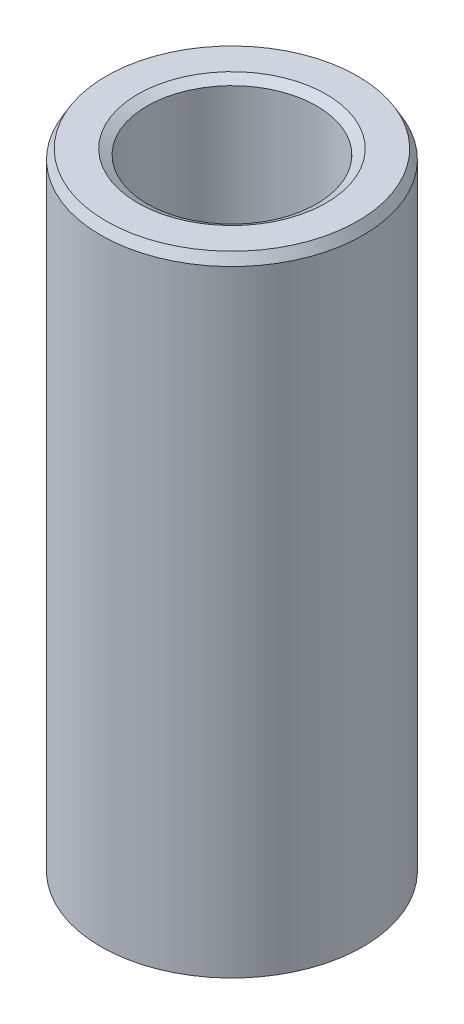
ISO-10303-21;
HEADER;
FILE_DESCRIPTION(('STEP AP214'),'2;1');
FILE_NAME('part.step','',(''),(''),'','','');
FILE_SCHEMA(('AUTOMOTIVE_DESIGN { 1 0 10303 214 1 1 1 1 }'));
ENDSEC;
DATA;
#1=APPLICATION_CONTEXT('core data for automotive mechanical design processes');
#2=APPLICATION_PROTOCOL_DEFINITION('international standard','automotive_design',2000,#1);
#3=PRODUCT_CONTEXT('',#1,'mechanical');
#4=PRODUCT('Part','Part','',(#3));
#5=PRODUCT_RELATED_PRODUCT_CATEGORY('part','',(#4));
#6=PRODUCT_DEFINITION_FORMATION('','',#4);
#7=PRODUCT_DEFINITION_CONTEXT('part definition',#1,'design');
#8=PRODUCT_DEFINITION('design','',#6,#7);
#9=PRODUCT_DEFINITION_SHAPE('','',#8);
#10=(LENGTH_UNIT() NAMED_UNIT(*) SI_UNIT(.MILLI.,.METRE.));
#11=(NAMED_UNIT(*) PLANE_ANGLE_UNIT() SI_UNIT($,.RADIAN.));
#12=(NAMED_UNIT(*) SI_UNIT($,.STERADIAN.) SOLID_ANGLE_UNIT());
#13=UNCERTAINTY_MEASURE_WITH_UNIT(LENGTH_MEASURE(1.E-05),#10,'distance_accuracy_value','');
#14=(GEOMETRIC_REPRESENTATION_CONTEXT(3) GLOBAL_UNCERTAINTY_ASSIGNED_CONTEXT((#13)) GLOBAL_UNIT_ASSIGNED_CONTEXT((#10,
#11,#12)) REPRESENTATION_CONTEXT('',''));
#15=CARTESIAN_POINT('',(0.,0.,0.));
#16=DIRECTION('',(0.,0.,1.));
#17=DIRECTION('',(1.,0.,0.));
#18=AXIS2_PLACEMENT_3D('',#15,#16,#17);
#19=CARTESIAN_POINT('',(0.,156.379065142094,0.));
#20=DIRECTION('',(0.,-1.,0.));
#21=DIRECTION('',(0.,0.,-1.));
#22=AXIS2_PLACEMENT_3D('',#19,#20,#21);
#23=CYLINDRICAL_SURFACE('',#22,32.5);
#24=CARTESIAN_POINT('',(0.,1.35039653749686,0.));
#25=DIRECTION('',(0.,1.,0.));
#26=DIRECTION('',(0.,0.,1.));
#27=AXIS2_PLACEMENT_3D('',#24,#25,#26);
#28=CIRCLE('',#27,32.5);
#29=CARTESIAN_POINT('',(0.,1.35039653749686,32.5));
#30=VERTEX_POINT('',#29);
#31=EDGE_CURVE('E10',#30,#30,#28,.T.);
#32=ORIENTED_EDGE('',*,*,#31,.T.);
#33=EDGE_LOOP('',(#32));
#34=FACE_BOUND('',#33,.T.);
#35=CARTESIAN_POINT('',(0.,154.040109728784,0.));
#36=DIRECTION('',(0.,1.,0.));
#37=DIRECTION('',(0.,0.,1.));
#38=AXIS2_PLACEMENT_3D('',#35,#36,#37);
#39=CIRCLE('',#38,32.5);
#40=CARTESIAN_POINT('',(0.,154.040109728784,32.5));
#41=VERTEX_POINT('',#40);
#42=EDGE_CURVE('E50',#41,#41,#39,.F.);
#43=ORIENTED_EDGE('',*,*,#42,.T.);
#44=EDGE_LOOP('',(#43));
#45=FACE_BOUND('',#44,.T.);
#46=ADVANCED_FACE('F39',(#34,#45),#23,.T.);
#47=CARTESIAN_POINT('',(0.,156.379065142094,0.));
#48=DIRECTION('',(0.,1.,0.));
#49=DIRECTION('',(0.,0.,1.));
#50=AXIS2_PLACEMENT_3D('',#47,#48,#49);
#51=PLANE('',#50);
#52=CARTESIAN_POINT('',(0.,156.379065142094,0.));
#53=DIRECTION('',(0.,1.,0.));
#54=DIRECTION('',(0.,0.,1.));
#55=AXIS2_PLACEMENT_3D('',#52,#53,#54);
#56=CIRCLE('',#55,23.3554708149167);
#57=CARTESIAN_POINT('',(0.,156.379065142094,23.3554708149167));
#58=VERTEX_POINT('',#57);
#59=EDGE_CURVE('E58',#58,#58,#56,.F.);
#60=ORIENTED_EDGE('',*,*,#59,.T.);
#61=EDGE_LOOP('',(#60));
#62=FACE_BOUND('',#61,.T.);
#63=CARTESIAN_POINT('',(0.,156.379065142094,0.));
#64=DIRECTION('',(0.,1.,0.));
#65=DIRECTION('',(0.,0.,1.));
#66=AXIS2_PLACEMENT_3D('',#63,#64,#65);
#67=CIRCLE('',#66,31.1496034625032);
#68=CARTESIAN_POINT('',(0.,156.379065142094,31.1496034625032));
#69=VERTEX_POINT('',#68);
#70=EDGE_CURVE('E61',#69,#69,#67,.T.);
#71=ORIENTED_EDGE('',*,*,#70,.T.);
#72=EDGE_LOOP('',(#71));
#73=FACE_BOUND('',#72,.T.);
#74=ADVANCED_FACE('F88',(#62,#73),#51,.T.);
#75=CARTESIAN_POINT('',(0.,0.,0.));
#76=DIRECTION('',(0.,1.,0.));
#77=DIRECTION('',(0.,0.,1.));
#78=AXIS2_PLACEMENT_3D('',#75,#76,#77);
#79=PLANE('',#78);
#80=CARTESIAN_POINT('',(0.,0.,0.));
#81=DIRECTION('',(0.,1.,0.));
#82=DIRECTION('',(0.,0.,1.));
#83=AXIS2_PLACEMENT_3D('',#80,#81,#82);
#84=CIRCLE('',#83,22.3669119391039);
#85=CARTESIAN_POINT('',(0.,0.,22.3669119391039));
#86=VERTEX_POINT('',#85);
#87=EDGE_CURVE('E51',#86,#86,#84,.T.);
#88=ORIENTED_EDGE('',*,*,#87,.T.);
#89=EDGE_LOOP('',(#88));
#90=FACE_BOUND('',#89,.T.);
#91=CARTESIAN_POINT('',(0.,0.,0.));
#92=DIRECTION('',(0.,1.,0.));
#93=DIRECTION('',(0.,0.,1.));
#94=AXIS2_PLACEMENT_3D('',#91,#92,#93);
#95=CIRCLE('',#94,30.1610445866904);
#96=CARTESIAN_POINT('',(0.,0.,30.1610445866904));
#97=VERTEX_POINT('',#96);
#98=EDGE_CURVE('E54',#97,#97,#95,.F.);
#99=ORIENTED_EDGE('',*,*,#98,.T.);
#100=EDGE_LOOP('',(#99));
#101=FACE_BOUND('',#100,.T.);
#102=ADVANCED_FACE('F83',(#90,#101),#79,.F.);
#103=CARTESIAN_POINT('',(0.,156.379065142094,0.));
#104=DIRECTION('',(0.,-1.,0.));
#105=DIRECTION('',(0.,0.,-1.));
#106=AXIS2_PLACEMENT_3D('',#103,#104,#105);
#107=CYLINDRICAL_SURFACE('',#106,21.0165154016071);
#108=CARTESIAN_POINT('',(0.,155.028668604597,0.));
#109=DIRECTION('',(0.,1.,0.));
#110=DIRECTION('',(0.,0.,1.));
#111=AXIS2_PLACEMENT_3D('',#108,#109,#110);
#112=CIRCLE('',#111,21.0165154016071);
#113=CARTESIAN_POINT('',(0.,155.028668604597,21.0165154016071));
#114=VERTEX_POINT('',#113);
#115=EDGE_CURVE('E67',#114,#114,#112,.T.);
#116=ORIENTED_EDGE('',*,*,#115,.T.);
#117=EDGE_LOOP('',(#116));
#118=FACE_BOUND('',#117,.T.);
#119=CARTESIAN_POINT('',(0.,2.33895541330964,0.));
#120=DIRECTION('',(0.,1.,0.));
#121=DIRECTION('',(0.,0.,1.));
#122=AXIS2_PLACEMENT_3D('',#119,#120,#121);
#123=CIRCLE('',#122,21.0165154016071);
#124=CARTESIAN_POINT('',(0.,2.33895541330964,21.0165154016071));
#125=VERTEX_POINT('',#124);
#126=EDGE_CURVE('E69',#125,#125,#123,.F.);
#127=ORIENTED_EDGE('',*,*,#126,.T.);
#128=EDGE_LOOP('',(#127));
#129=FACE_BOUND('',#128,.T.);
#130=ADVANCED_FACE('F71',(#118,#129),#107,.F.);
#131=CARTESIAN_POINT('',(0.,155.028668604597,0.));
#132=DIRECTION('',(0.,1.,0.));
#133=DIRECTION('',(0.,0.,1.));
#134=AXIS2_PLACEMENT_3D('',#131,#132,#133);
#135=CONICAL_SURFACE('',#134,21.0165154016071,1.0471975511966);
#136=ORIENTED_EDGE('',*,*,#59,.F.);
#137=EDGE_LOOP('',(#136));
#138=FACE_BOUND('',#137,.T.);
#139=ORIENTED_EDGE('',*,*,#115,.F.);
#140=EDGE_LOOP('',(#139));
#141=FACE_BOUND('',#140,.T.);
#142=ADVANCED_FACE('F77',(#138,#141),#135,.F.);
#143=CARTESIAN_POINT('',(0.,0.,0.));
#144=DIRECTION('',(0.,-1.,0.));
#145=DIRECTION('',(0.,0.,-1.));
#146=AXIS2_PLACEMENT_3D('',#143,#144,#145);
#147=CONICAL_SURFACE('',#146,22.3669119391039,0.523598775598295);
#148=ORIENTED_EDGE('',*,*,#126,.F.);
#149=EDGE_LOOP('',(#148));
#150=FACE_BOUND('',#149,.T.);
#151=ORIENTED_EDGE('',*,*,#87,.F.);
#152=EDGE_LOOP('',(#151));
#153=FACE_BOUND('',#152,.T.);
#154=ADVANCED_FACE('F73',(#150,#153),#147,.F.);
#155=CARTESIAN_POINT('',(0.,1.35039653749686,0.));
#156=DIRECTION('',(0.,1.,0.));
#157=DIRECTION('',(0.,0.,1.));
#158=AXIS2_PLACEMENT_3D('',#155,#156,#157);
#159=CONICAL_SURFACE('',#158,32.5,1.0471975511966);
#160=ORIENTED_EDGE('',*,*,#98,.F.);
#161=EDGE_LOOP('',(#160));
#162=FACE_BOUND('',#161,.T.);
#163=ORIENTED_EDGE('',*,*,#31,.F.);
#164=EDGE_LOOP('',(#163));
#165=FACE_BOUND('',#164,.T.);
#166=ADVANCED_FACE('F76',(#162,#165),#159,.T.);
#167=CARTESIAN_POINT('',(0.,156.379065142094,0.));
#168=DIRECTION('',(0.,-1.,0.));
#169=DIRECTION('',(0.,0.,-1.));
#170=AXIS2_PLACEMENT_3D('',#167,#168,#169);
#171=CONICAL_SURFACE('',#170,31.1496034625032,0.523598775598292);
#172=ORIENTED_EDGE('',*,*,#42,.F.);
#173=EDGE_LOOP('',(#172));
#174=FACE_BOUND('',#173,.T.);
#175=ORIENTED_EDGE('',*,*,#70,.F.);
#176=EDGE_LOOP('',(#175));
#177=FACE_BOUND('',#176,.T.);
#178=ADVANCED_FACE('F45',(#174,#177),#171,.T.);
#179=CLOSED_SHELL('',(#46,#74,#102,#130,#142,#154,#166,#178));
#180=MANIFOLD_SOLID_BREP('B2',#179);
#181=ADVANCED_BREP_SHAPE_REPRESENTATION('',(#18,#180),#14);
#182=SHAPE_DEFINITION_REPRESENTATION(#9,#181);
ENDSEC;
END-ISO-10303-21;
